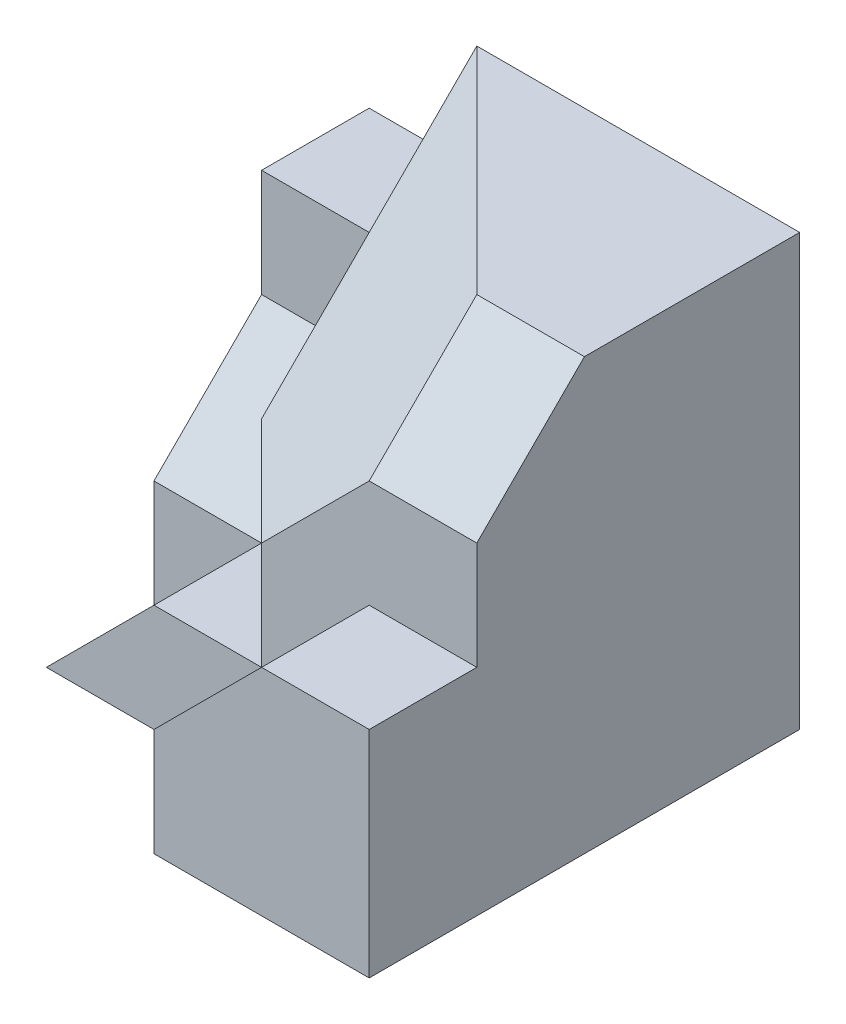
ISO-10303-21;
HEADER;
FILE_DESCRIPTION(('STEP AP214'),'2;1');
FILE_NAME('part.step','',(''),(''),'','','');
FILE_SCHEMA(('AUTOMOTIVE_DESIGN { 1 0 10303 214 1 1 1 1 }'));
ENDSEC;
DATA;
#1=APPLICATION_CONTEXT('core data for automotive mechanical design processes');
#2=APPLICATION_PROTOCOL_DEFINITION('international standard','automotive_design',2000,#1);
#3=PRODUCT_CONTEXT('',#1,'mechanical');
#4=PRODUCT('Part','Part','',(#3));
#5=PRODUCT_RELATED_PRODUCT_CATEGORY('part','',(#4));
#6=PRODUCT_DEFINITION_FORMATION('','',#4);
#7=PRODUCT_DEFINITION_CONTEXT('part definition',#1,'design');
#8=PRODUCT_DEFINITION('design','',#6,#7);
#9=PRODUCT_DEFINITION_SHAPE('','',#8);
#10=(LENGTH_UNIT() NAMED_UNIT(*) SI_UNIT(.MILLI.,.METRE.));
#11=(NAMED_UNIT(*) PLANE_ANGLE_UNIT() SI_UNIT($,.RADIAN.));
#12=(NAMED_UNIT(*) SI_UNIT($,.STERADIAN.) SOLID_ANGLE_UNIT());
#13=UNCERTAINTY_MEASURE_WITH_UNIT(LENGTH_MEASURE(1.E-05),#10,'distance_accuracy_value','');
#14=(GEOMETRIC_REPRESENTATION_CONTEXT(3) GLOBAL_UNCERTAINTY_ASSIGNED_CONTEXT((#13)) GLOBAL_UNIT_ASSIGNED_CONTEXT((#10,
#11,#12)) REPRESENTATION_CONTEXT('',''));
#15=CARTESIAN_POINT('',(0.,0.,0.));
#16=DIRECTION('',(0.,0.,1.));
#17=DIRECTION('',(1.,0.,0.));
#18=AXIS2_PLACEMENT_3D('',#15,#16,#17);
#19=CARTESIAN_POINT('',(-15.,-12.,10.));
#20=DIRECTION('',(0.707106781186548,0.,-0.707106781186548));
#21=DIRECTION('',(-0.707106781186548,0.,-0.707106781186548));
#22=AXIS2_PLACEMENT_3D('',#19,#20,#21);
#23=PLANE('',#22);
#24=DIRECTION('',(0.707106781186548,0.,0.707106781186548));
#25=VECTOR('',#24,1.);
#26=CARTESIAN_POINT('',(-15.,5.,10.));
#27=LINE('',#26,#25);
#28=CARTESIAN_POINT('',(-15.,5.,10.));
#29=VERTEX_POINT('',#28);
#30=CARTESIAN_POINT('',(-10.,5.,15.));
#31=VERTEX_POINT('',#30);
#32=EDGE_CURVE('E198',#29,#31,#27,.T.);
#33=ORIENTED_EDGE('',*,*,#32,.T.);
#34=DIRECTION('',(0.,1.,0.));
#35=VECTOR('',#34,1.);
#36=CARTESIAN_POINT('',(-10.,-12.,15.));
#37=LINE('',#36,#35);
#38=CARTESIAN_POINT('',(-10.,10.,15.));
#39=VERTEX_POINT('',#38);
#40=EDGE_CURVE('E236',#31,#39,#37,.T.);
#41=ORIENTED_EDGE('',*,*,#40,.T.);
#42=DIRECTION('',(-0.707106781186548,0.,-0.707106781186548));
#43=VECTOR('',#42,1.);
#44=CARTESIAN_POINT('',(-10.,10.,15.));
#45=LINE('',#44,#43);
#46=CARTESIAN_POINT('',(-15.,10.,10.));
#47=VERTEX_POINT('',#46);
#48=EDGE_CURVE('E244',#39,#47,#45,.T.);
#49=ORIENTED_EDGE('',*,*,#48,.T.);
#50=DIRECTION('',(0.,1.,0.));
#51=VECTOR('',#50,1.);
#52=CARTESIAN_POINT('',(-15.,-12.,10.));
#53=LINE('',#52,#51);
#54=EDGE_CURVE('E248',#29,#47,#53,.T.);
#55=ORIENTED_EDGE('',*,*,#54,.F.);
#56=EDGE_LOOP('',(#33,#41,#49,#55));
#57=FACE_BOUND('',#56,.T.);
#58=ADVANCED_FACE('F34',(#57),#23,.F.);
#59=CARTESIAN_POINT('',(-15.,20.,15.));
#60=DIRECTION('',(-1.,0.,0.));
#61=DIRECTION('',(0.,0.,1.));
#62=AXIS2_PLACEMENT_3D('',#59,#60,#61);
#63=PLANE('',#62);
#64=DIRECTION('',(0.,0.,-1.));
#65=VECTOR('',#64,1.);
#66=CARTESIAN_POINT('',(-15.,15.,0.));
#67=LINE('',#66,#65);
#68=CARTESIAN_POINT('',(-15.,15.,5.));
#69=VERTEX_POINT('',#68);
#70=CARTESIAN_POINT('',(-15.,15.,0.));
#71=VERTEX_POINT('',#70);
#72=EDGE_CURVE('E54',#69,#71,#67,.T.);
#73=ORIENTED_EDGE('',*,*,#72,.F.);
#74=DIRECTION('',(0.,0.707106781186548,-0.707106781186547));
#75=VECTOR('',#74,1.);
#76=CARTESIAN_POINT('',(-15.,10.,10.));
#77=LINE('',#76,#75);
#78=CARTESIAN_POINT('',(-15.,20.,0.));
#79=VERTEX_POINT('',#78);
#80=EDGE_CURVE('E255',#69,#79,#77,.T.);
#81=ORIENTED_EDGE('',*,*,#80,.T.);
#82=DIRECTION('',(0.,-1.,0.));
#83=VECTOR('',#82,1.);
#84=CARTESIAN_POINT('',(-15.,20.,0.));
#85=LINE('',#84,#83);
#86=EDGE_CURVE('E51',#79,#71,#85,.T.);
#87=ORIENTED_EDGE('',*,*,#86,.T.);
#88=EDGE_LOOP('',(#73,#81,#87));
#89=FACE_BOUND('',#88,.T.);
#90=ADVANCED_FACE('F295',(#89),#63,.T.);
#91=CARTESIAN_POINT('',(0.,20.,15.));
#92=DIRECTION('',(0.,0.,-1.));
#93=DIRECTION('',(-1.,0.,0.));
#94=AXIS2_PLACEMENT_3D('',#91,#92,#93);
#95=PLANE('',#94);
#96=DIRECTION('',(-0.707106781186548,-0.707106781186547,0.));
#97=VECTOR('',#96,1.);
#98=CARTESIAN_POINT('',(-10.,5.,15.));
#99=LINE('',#98,#97);
#100=CARTESIAN_POINT('',(-5.,10.,15.));
#101=VERTEX_POINT('',#100);
#102=EDGE_CURVE('E151',#101,#31,#99,.T.);
#103=ORIENTED_EDGE('',*,*,#102,.F.);
#104=DIRECTION('',(-1.,0.,0.));
#105=VECTOR('',#104,1.);
#106=CARTESIAN_POINT('',(-5.,10.,15.));
#107=LINE('',#106,#105);
#108=CARTESIAN_POINT('',(0.,10.,15.));
#109=VERTEX_POINT('',#108);
#110=EDGE_CURVE('E358',#109,#101,#107,.T.);
#111=ORIENTED_EDGE('',*,*,#110,.F.);
#112=DIRECTION('',(0.,-1.,0.));
#113=VECTOR('',#112,1.);
#114=CARTESIAN_POINT('',(0.,20.,15.));
#115=LINE('',#114,#113);
#116=CARTESIAN_POINT('',(0.,15.0000000000001,15.));
#117=VERTEX_POINT('',#116);
#118=EDGE_CURVE('E43',#117,#109,#115,.T.);
#119=ORIENTED_EDGE('',*,*,#118,.F.);
#120=DIRECTION('',(-1.,0.,0.));
#121=VECTOR('',#120,1.);
#122=CARTESIAN_POINT('',(25.,15.0000000000001,15.));
#123=LINE('',#122,#121);
#124=CARTESIAN_POINT('',(-4.99999999999999,15.0000000000001,15.));
#125=VERTEX_POINT('',#124);
#126=EDGE_CURVE('E402',#117,#125,#123,.T.);
#127=ORIENTED_EDGE('',*,*,#126,.T.);
#128=DIRECTION('',(-0.707106781186539,-0.707106781186556,0.));
#129=VECTOR('',#128,1.);
#130=CARTESIAN_POINT('',(-4.99999999999999,15.0000000000001,15.));
#131=LINE('',#130,#129);
#132=EDGE_CURVE('E247',#125,#39,#131,.T.);
#133=ORIENTED_EDGE('',*,*,#132,.T.);
#134=ORIENTED_EDGE('',*,*,#40,.F.);
#135=EDGE_LOOP('',(#103,#111,#119,#127,#133,#134));
#136=FACE_BOUND('',#135,.T.);
#137=ADVANCED_FACE('F36',(#136),#95,.F.);
#138=CARTESIAN_POINT('',(0.,20.,0.));
#139=DIRECTION('',(-1.,0.,0.));
#140=DIRECTION('',(0.,0.,1.));
#141=AXIS2_PLACEMENT_3D('',#138,#139,#140);
#142=PLANE('',#141);
#143=DIRECTION('',(0.,0.,-1.));
#144=VECTOR('',#143,1.);
#145=CARTESIAN_POINT('',(0.,20.,0.));
#146=LINE('',#145,#144);
#147=CARTESIAN_POINT('',(0.,20.,10.));
#148=VERTEX_POINT('',#147);
#149=CARTESIAN_POINT('',(0.,20.,0.));
#150=VERTEX_POINT('',#149);
#151=EDGE_CURVE('E334',#148,#150,#146,.T.);
#152=ORIENTED_EDGE('',*,*,#151,.F.);
#153=DIRECTION('',(0.,-0.707106781186539,0.707106781186556));
#154=VECTOR('',#153,1.);
#155=CARTESIAN_POINT('',(0.,25.,4.99999999999988));
#156=LINE('',#155,#154);
#157=EDGE_CURVE('E336',#148,#117,#156,.T.);
#158=ORIENTED_EDGE('',*,*,#157,.T.);
#159=ORIENTED_EDGE('',*,*,#118,.T.);
#160=DIRECTION('',(0.,0.,-1.));
#161=VECTOR('',#160,1.);
#162=CARTESIAN_POINT('',(0.,10.,20.));
#163=LINE('',#162,#161);
#164=CARTESIAN_POINT('',(0.,10.,20.));
#165=VERTEX_POINT('',#164);
#166=EDGE_CURVE('E233',#165,#109,#163,.T.);
#167=ORIENTED_EDGE('',*,*,#166,.F.);
#168=DIRECTION('',(0.,1.,0.));
#169=VECTOR('',#168,1.);
#170=CARTESIAN_POINT('',(0.,10.,20.));
#171=LINE('',#170,#169);
#172=CARTESIAN_POINT('',(0.,0.,20.));
#173=VERTEX_POINT('',#172);
#174=EDGE_CURVE('E372',#173,#165,#171,.T.);
#175=ORIENTED_EDGE('',*,*,#174,.F.);
#176=DIRECTION('',(0.,0.,-1.));
#177=VECTOR('',#176,1.);
#178=CARTESIAN_POINT('',(0.,0.,0.));
#179=LINE('',#178,#177);
#180=CARTESIAN_POINT('',(0.,0.,0.));
#181=VERTEX_POINT('',#180);
#182=EDGE_CURVE('E344',#173,#181,#179,.T.);
#183=ORIENTED_EDGE('',*,*,#182,.T.);
#184=DIRECTION('',(0.,-1.,0.));
#185=VECTOR('',#184,1.);
#186=CARTESIAN_POINT('',(0.,20.,0.));
#187=LINE('',#186,#185);
#188=EDGE_CURVE('E339',#150,#181,#187,.T.);
#189=ORIENTED_EDGE('',*,*,#188,.F.);
#190=EDGE_LOOP('',(#152,#158,#159,#167,#175,#183,#189));
#191=FACE_BOUND('',#190,.T.);
#192=ADVANCED_FACE('F302',(#191),#142,.F.);
#193=CARTESIAN_POINT('',(-15.,20.,0.));
#194=DIRECTION('',(0.,0.,1.));
#195=DIRECTION('',(1.,0.,0.));
#196=AXIS2_PLACEMENT_3D('',#193,#194,#195);
#197=PLANE('',#196);
#198=DIRECTION('',(-1.,0.,0.));
#199=VECTOR('',#198,1.);
#200=CARTESIAN_POINT('',(-15.,0.,0.));
#201=LINE('',#200,#199);
#202=CARTESIAN_POINT('',(-20.,0.,0.));
#203=VERTEX_POINT('',#202);
#204=EDGE_CURVE('E341',#181,#203,#201,.T.);
#205=ORIENTED_EDGE('',*,*,#204,.T.);
#206=DIRECTION('',(0.,-1.,0.));
#207=VECTOR('',#206,1.);
#208=CARTESIAN_POINT('',(-20.,0.,0.));
#209=LINE('',#208,#207);
#210=CARTESIAN_POINT('',(-20.,15.,0.));
#211=VERTEX_POINT('',#210);
#212=EDGE_CURVE('E175',#211,#203,#209,.T.);
#213=ORIENTED_EDGE('',*,*,#212,.F.);
#214=DIRECTION('',(1.,0.,0.));
#215=VECTOR('',#214,1.);
#216=CARTESIAN_POINT('',(-20.,15.,0.));
#217=LINE('',#216,#215);
#218=EDGE_CURVE('E177',#211,#71,#217,.T.);
#219=ORIENTED_EDGE('',*,*,#218,.T.);
#220=ORIENTED_EDGE('',*,*,#86,.F.);
#221=DIRECTION('',(-1.,0.,0.));
#222=VECTOR('',#221,1.);
#223=CARTESIAN_POINT('',(-15.,20.,0.));
#224=LINE('',#223,#222);
#225=EDGE_CURVE('E340',#150,#79,#224,.T.);
#226=ORIENTED_EDGE('',*,*,#225,.F.);
#227=ORIENTED_EDGE('',*,*,#188,.T.);
#228=EDGE_LOOP('',(#205,#213,#219,#220,#226,#227));
#229=FACE_BOUND('',#228,.T.);
#230=ADVANCED_FACE('F275',(#229),#197,.F.);
#231=CARTESIAN_POINT('',(0.,20.,0.));
#232=DIRECTION('',(0.,-1.,0.));
#233=DIRECTION('',(0.,0.,-1.));
#234=AXIS2_PLACEMENT_3D('',#231,#232,#233);
#235=PLANE('',#234);
#236=ORIENTED_EDGE('',*,*,#225,.T.);
#237=DIRECTION('',(0.707106781186548,0.,0.707106781186547));
#238=VECTOR('',#237,1.);
#239=CARTESIAN_POINT('',(-15.,20.,0.));
#240=LINE('',#239,#238);
#241=CARTESIAN_POINT('',(-4.99999999999999,20.,10.));
#242=VERTEX_POINT('',#241);
#243=EDGE_CURVE('E258',#79,#242,#240,.T.);
#244=ORIENTED_EDGE('',*,*,#243,.T.);
#245=DIRECTION('',(1.,0.,0.));
#246=VECTOR('',#245,1.);
#247=CARTESIAN_POINT('',(0.,20.,10.));
#248=LINE('',#247,#246);
#249=EDGE_CURVE('E12',#242,#148,#248,.T.);
#250=ORIENTED_EDGE('',*,*,#249,.T.);
#251=ORIENTED_EDGE('',*,*,#151,.T.);
#252=EDGE_LOOP('',(#236,#244,#250,#251));
#253=FACE_BOUND('',#252,.T.);
#254=ADVANCED_FACE('F319',(#253),#235,.F.);
#255=CARTESIAN_POINT('',(0.,0.,0.));
#256=DIRECTION('',(0.,-1.,0.));
#257=DIRECTION('',(0.,0.,-1.));
#258=AXIS2_PLACEMENT_3D('',#255,#256,#257);
#259=PLANE('',#258);
#260=DIRECTION('',(0.,0.,-1.));
#261=VECTOR('',#260,1.);
#262=CARTESIAN_POINT('',(-10.,0.,20.));
#263=LINE('',#262,#261);
#264=CARTESIAN_POINT('',(-10.,0.,20.));
#265=VERTEX_POINT('',#264);
#266=CARTESIAN_POINT('',(-10.,0.,15.));
#267=VERTEX_POINT('',#266);
#268=EDGE_CURVE('E228',#265,#267,#263,.T.);
#269=ORIENTED_EDGE('',*,*,#268,.T.);
#270=DIRECTION('',(-1.,0.,0.));
#271=VECTOR('',#270,1.);
#272=CARTESIAN_POINT('',(-10.,0.,15.));
#273=LINE('',#272,#271);
#274=CARTESIAN_POINT('',(-20.,0.,15.));
#275=VERTEX_POINT('',#274);
#276=EDGE_CURVE('E203',#267,#275,#273,.T.);
#277=ORIENTED_EDGE('',*,*,#276,.T.);
#278=DIRECTION('',(0.,0.,1.));
#279=VECTOR('',#278,1.);
#280=CARTESIAN_POINT('',(-20.,0.,10.));
#281=LINE('',#280,#279);
#282=CARTESIAN_POINT('',(-20.,0.,10.));
#283=VERTEX_POINT('',#282);
#284=EDGE_CURVE('E210',#283,#275,#281,.T.);
#285=ORIENTED_EDGE('',*,*,#284,.F.);
#286=DIRECTION('',(0.,0.,1.));
#287=VECTOR('',#286,1.);
#288=CARTESIAN_POINT('',(-20.,0.,10.));
#289=LINE('',#288,#287);
#290=EDGE_CURVE('E161',#203,#283,#289,.T.);
#291=ORIENTED_EDGE('',*,*,#290,.F.);
#292=ORIENTED_EDGE('',*,*,#204,.F.);
#293=ORIENTED_EDGE('',*,*,#182,.F.);
#294=DIRECTION('',(1.,0.,0.));
#295=VECTOR('',#294,1.);
#296=CARTESIAN_POINT('',(0.,0.,20.));
#297=LINE('',#296,#295);
#298=EDGE_CURVE('E230',#265,#173,#297,.T.);
#299=ORIENTED_EDGE('',*,*,#298,.F.);
#300=EDGE_LOOP('',(#269,#277,#285,#291,#292,#293,#299));
#301=FACE_BOUND('',#300,.T.);
#302=ADVANCED_FACE('F225',(#301),#259,.T.);
#303=CARTESIAN_POINT('',(25.,20.,10.));
#304=DIRECTION('',(0.,-0.707106781186556,-0.707106781186539));
#305=DIRECTION('',(0.,0.707106781186539,-0.707106781186556));
#306=AXIS2_PLACEMENT_3D('',#303,#304,#305);
#307=PLANE('',#306);
#308=ORIENTED_EDGE('',*,*,#249,.F.);
#309=DIRECTION('',(0.,-0.707106781186539,0.707106781186556));
#310=VECTOR('',#309,1.);
#311=CARTESIAN_POINT('',(-4.99999999999999,20.,10.));
#312=LINE('',#311,#310);
#313=EDGE_CURVE('E254',#242,#125,#312,.T.);
#314=ORIENTED_EDGE('',*,*,#313,.T.);
#315=ORIENTED_EDGE('',*,*,#126,.F.);
#316=ORIENTED_EDGE('',*,*,#157,.F.);
#317=EDGE_LOOP('',(#308,#314,#315,#316));
#318=FACE_BOUND('',#317,.T.);
#319=ADVANCED_FACE('F309',(#318),#307,.F.);
#320=DIRECTION('',(0.,1.,0.));
#321=VECTOR('',#320,1.);
#322=CARTESIAN_POINT('',(-15.,15.,5.));
#323=LINE('',#322,#321);
#324=CARTESIAN_POINT('',(-15.,10.,5.));
#325=VERTEX_POINT('',#324);
#326=EDGE_CURVE('E183',#325,#69,#323,.T.);
#327=ORIENTED_EDGE('',*,*,#326,.F.);
#328=DIRECTION('',(0.,0.707106781186548,-0.707106781186547));
#329=VECTOR('',#328,1.);
#330=CARTESIAN_POINT('',(-15.,10.,5.));
#331=LINE('',#330,#329);
#332=EDGE_CURVE('E187',#29,#325,#331,.T.);
#333=ORIENTED_EDGE('',*,*,#332,.F.);
#334=ORIENTED_EDGE('',*,*,#54,.T.);
#335=EDGE_CURVE('E251',#47,#69,#77,.T.);
#336=ORIENTED_EDGE('',*,*,#335,.T.);
#337=EDGE_LOOP('',(#327,#333,#334,#336));
#338=FACE_BOUND('',#337,.T.);
#339=ADVANCED_FACE('F285',(#338),#63,.T.);
#340=CARTESIAN_POINT('',(-11.6666666666667,11.6666666666667,11.6666666666666));
#341=DIRECTION('',(0.577350269189628,-0.577350269189626,-0.577350269189624));
#342=DIRECTION('',(0.707106781186546,0.707106781186549,0.));
#343=AXIS2_PLACEMENT_3D('',#340,#341,#342);
#344=PLANE('',#343);
#345=ORIENTED_EDGE('',*,*,#48,.F.);
#346=ORIENTED_EDGE('',*,*,#132,.F.);
#347=ORIENTED_EDGE('',*,*,#313,.F.);
#348=ORIENTED_EDGE('',*,*,#243,.F.);
#349=ORIENTED_EDGE('',*,*,#80,.F.);
#350=ORIENTED_EDGE('',*,*,#335,.F.);
#351=EDGE_LOOP('',(#345,#346,#347,#348,#349,#350));
#352=FACE_BOUND('',#351,.T.);
#353=ADVANCED_FACE('F290',(#352),#344,.F.);
#354=CARTESIAN_POINT('',(-10.,5.,20.));
#355=DIRECTION('',(0.707106781186547,-0.707106781186548,0.));
#356=DIRECTION('',(0.707106781186548,0.707106781186547,0.));
#357=AXIS2_PLACEMENT_3D('',#354,#355,#356);
#358=PLANE('',#357);
#359=ORIENTED_EDGE('',*,*,#102,.T.);
#360=DIRECTION('',(0.,0.,-1.));
#361=VECTOR('',#360,1.);
#362=CARTESIAN_POINT('',(-10.,5.,20.));
#363=LINE('',#362,#361);
#364=CARTESIAN_POINT('',(-10.,5.,20.));
#365=VERTEX_POINT('',#364);
#366=EDGE_CURVE('E232',#365,#31,#363,.T.);
#367=ORIENTED_EDGE('',*,*,#366,.F.);
#368=DIRECTION('',(-0.707106781186548,-0.707106781186547,0.));
#369=VECTOR('',#368,1.);
#370=CARTESIAN_POINT('',(-10.,5.,20.));
#371=LINE('',#370,#369);
#372=CARTESIAN_POINT('',(-5.,10.,20.));
#373=VERTEX_POINT('',#372);
#374=EDGE_CURVE('E361',#373,#365,#371,.T.);
#375=ORIENTED_EDGE('',*,*,#374,.F.);
#376=DIRECTION('',(0.,0.,-1.));
#377=VECTOR('',#376,1.);
#378=CARTESIAN_POINT('',(-5.,10.,20.));
#379=LINE('',#378,#377);
#380=EDGE_CURVE('E239',#373,#101,#379,.T.);
#381=ORIENTED_EDGE('',*,*,#380,.T.);
#382=EDGE_LOOP('',(#359,#367,#375,#381));
#383=FACE_BOUND('',#382,.T.);
#384=ADVANCED_FACE('F314',(#383),#358,.F.);
#385=CARTESIAN_POINT('',(-10.,0.,20.));
#386=DIRECTION('',(1.,0.,0.));
#387=DIRECTION('',(0.,0.,-1.));
#388=AXIS2_PLACEMENT_3D('',#385,#386,#387);
#389=PLANE('',#388);
#390=EDGE_CURVE('E387',#267,#31,#37,.T.);
#391=ORIENTED_EDGE('',*,*,#390,.F.);
#392=ORIENTED_EDGE('',*,*,#268,.F.);
#393=DIRECTION('',(0.,-1.,0.));
#394=VECTOR('',#393,1.);
#395=CARTESIAN_POINT('',(-10.,0.,20.));
#396=LINE('',#395,#394);
#397=EDGE_CURVE('E375',#365,#265,#396,.T.);
#398=ORIENTED_EDGE('',*,*,#397,.F.);
#399=ORIENTED_EDGE('',*,*,#366,.T.);
#400=EDGE_LOOP('',(#391,#392,#398,#399));
#401=FACE_BOUND('',#400,.T.);
#402=ADVANCED_FACE('F386',(#401),#389,.F.);
#403=CARTESIAN_POINT('',(-5.,10.,20.));
#404=DIRECTION('',(0.,-1.,0.));
#405=DIRECTION('',(0.,0.,-1.));
#406=AXIS2_PLACEMENT_3D('',#403,#404,#405);
#407=PLANE('',#406);
#408=ORIENTED_EDGE('',*,*,#110,.T.);
#409=ORIENTED_EDGE('',*,*,#380,.F.);
#410=DIRECTION('',(-1.,0.,0.));
#411=VECTOR('',#410,1.);
#412=CARTESIAN_POINT('',(-5.,10.,20.));
#413=LINE('',#412,#411);
#414=EDGE_CURVE('E370',#165,#373,#413,.T.);
#415=ORIENTED_EDGE('',*,*,#414,.F.);
#416=ORIENTED_EDGE('',*,*,#166,.T.);
#417=EDGE_LOOP('',(#408,#409,#415,#416));
#418=FACE_BOUND('',#417,.T.);
#419=ADVANCED_FACE('F431',(#418),#407,.F.);
#420=CARTESIAN_POINT('',(0.,0.,20.));
#421=DIRECTION('',(0.,0.,-1.));
#422=DIRECTION('',(-1.,0.,0.));
#423=AXIS2_PLACEMENT_3D('',#420,#421,#422);
#424=PLANE('',#423);
#425=ORIENTED_EDGE('',*,*,#374,.T.);
#426=ORIENTED_EDGE('',*,*,#397,.T.);
#427=ORIENTED_EDGE('',*,*,#298,.T.);
#428=ORIENTED_EDGE('',*,*,#174,.T.);
#429=ORIENTED_EDGE('',*,*,#414,.T.);
#430=EDGE_LOOP('',(#425,#426,#427,#428,#429));
#431=FACE_BOUND('',#430,.T.);
#432=ADVANCED_FACE('F381',(#431),#424,.F.);
#433=CARTESIAN_POINT('',(-20.,10.,5.));
#434=DIRECTION('',(0.,-0.707106781186547,-0.707106781186548));
#435=DIRECTION('',(0.,0.707106781186548,-0.707106781186547));
#436=AXIS2_PLACEMENT_3D('',#433,#434,#435);
#437=PLANE('',#436);
#438=ORIENTED_EDGE('',*,*,#332,.T.);
#439=DIRECTION('',(1.,0.,0.));
#440=VECTOR('',#439,1.);
#441=CARTESIAN_POINT('',(-20.,10.,5.));
#442=LINE('',#441,#440);
#443=CARTESIAN_POINT('',(-20.,10.,5.));
#444=VERTEX_POINT('',#443);
#445=EDGE_CURVE('E152',#444,#325,#442,.T.);
#446=ORIENTED_EDGE('',*,*,#445,.F.);
#447=DIRECTION('',(0.,0.707106781186548,-0.707106781186547));
#448=VECTOR('',#447,1.);
#449=CARTESIAN_POINT('',(-20.,10.,5.));
#450=LINE('',#449,#448);
#451=CARTESIAN_POINT('',(-20.,5.,10.));
#452=VERTEX_POINT('',#451);
#453=EDGE_CURVE('E157',#452,#444,#450,.T.);
#454=ORIENTED_EDGE('',*,*,#453,.F.);
#455=DIRECTION('',(1.,0.,0.));
#456=VECTOR('',#455,1.);
#457=CARTESIAN_POINT('',(-20.,5.,10.));
#458=LINE('',#457,#456);
#459=EDGE_CURVE('E141',#452,#29,#458,.T.);
#460=ORIENTED_EDGE('',*,*,#459,.T.);
#461=EDGE_LOOP('',(#438,#446,#454,#460));
#462=FACE_BOUND('',#461,.T.);
#463=ADVANCED_FACE('F164',(#462),#437,.F.);
#464=CARTESIAN_POINT('',(-20.,15.,5.));
#465=DIRECTION('',(0.,0.,-1.));
#466=DIRECTION('',(0.,1.,0.));
#467=AXIS2_PLACEMENT_3D('',#464,#465,#466);
#468=PLANE('',#467);
#469=ORIENTED_EDGE('',*,*,#326,.T.);
#470=DIRECTION('',(1.,0.,0.));
#471=VECTOR('',#470,1.);
#472=CARTESIAN_POINT('',(-20.,15.,5.));
#473=LINE('',#472,#471);
#474=CARTESIAN_POINT('',(-20.,15.,5.));
#475=VERTEX_POINT('',#474);
#476=EDGE_CURVE('E190',#475,#69,#473,.T.);
#477=ORIENTED_EDGE('',*,*,#476,.F.);
#478=DIRECTION('',(0.,1.,0.));
#479=VECTOR('',#478,1.);
#480=CARTESIAN_POINT('',(-20.,15.,5.));
#481=LINE('',#480,#479);
#482=EDGE_CURVE('E167',#444,#475,#481,.T.);
#483=ORIENTED_EDGE('',*,*,#482,.F.);
#484=ORIENTED_EDGE('',*,*,#445,.T.);
#485=EDGE_LOOP('',(#469,#477,#483,#484));
#486=FACE_BOUND('',#485,.T.);
#487=ADVANCED_FACE('F282',(#486),#468,.F.);
#488=CARTESIAN_POINT('',(-20.,15.,0.));
#489=DIRECTION('',(0.,-1.,0.));
#490=DIRECTION('',(0.,0.,-1.));
#491=AXIS2_PLACEMENT_3D('',#488,#489,#490);
#492=PLANE('',#491);
#493=ORIENTED_EDGE('',*,*,#72,.T.);
#494=ORIENTED_EDGE('',*,*,#218,.F.);
#495=DIRECTION('',(0.,0.,-1.));
#496=VECTOR('',#495,1.);
#497=CARTESIAN_POINT('',(-20.,15.,0.));
#498=LINE('',#497,#496);
#499=EDGE_CURVE('E169',#475,#211,#498,.T.);
#500=ORIENTED_EDGE('',*,*,#499,.F.);
#501=ORIENTED_EDGE('',*,*,#476,.T.);
#502=EDGE_LOOP('',(#493,#494,#500,#501));
#503=FACE_BOUND('',#502,.T.);
#504=ADVANCED_FACE('F279',(#503),#492,.F.);
#505=CARTESIAN_POINT('',(-20.,0.,0.));
#506=DIRECTION('',(1.,0.,0.));
#507=DIRECTION('',(0.,0.,-1.));
#508=AXIS2_PLACEMENT_3D('',#505,#506,#507);
#509=PLANE('',#508);
#510=ORIENTED_EDGE('',*,*,#290,.T.);
#511=DIRECTION('',(0.,-1.,0.));
#512=VECTOR('',#511,1.);
#513=CARTESIAN_POINT('',(-20.,0.,10.));
#514=LINE('',#513,#512);
#515=EDGE_CURVE('E144',#452,#283,#514,.T.);
#516=ORIENTED_EDGE('',*,*,#515,.F.);
#517=ORIENTED_EDGE('',*,*,#453,.T.);
#518=ORIENTED_EDGE('',*,*,#482,.T.);
#519=ORIENTED_EDGE('',*,*,#499,.T.);
#520=ORIENTED_EDGE('',*,*,#212,.T.);
#521=EDGE_LOOP('',(#510,#516,#517,#518,#519,#520));
#522=FACE_BOUND('',#521,.T.);
#523=ADVANCED_FACE('F156',(#522),#509,.F.);
#524=CARTESIAN_POINT('',(-10.,5.,15.));
#525=DIRECTION('',(0.,0.,1.));
#526=DIRECTION('',(1.,0.,0.));
#527=AXIS2_PLACEMENT_3D('',#524,#525,#526);
#528=PLANE('',#527);
#529=DIRECTION('',(0.707106781186547,0.707106781186548,0.));
#530=VECTOR('',#529,1.);
#531=CARTESIAN_POINT('',(-15.,5.,15.));
#532=LINE('',#531,#530);
#533=CARTESIAN_POINT('',(-15.,5.,15.));
#534=VERTEX_POINT('',#533);
#535=EDGE_CURVE('E207',#275,#534,#532,.T.);
#536=ORIENTED_EDGE('',*,*,#535,.F.);
#537=ORIENTED_EDGE('',*,*,#276,.F.);
#538=ORIENTED_EDGE('',*,*,#390,.T.);
#539=DIRECTION('',(-1.,0.,0.));
#540=VECTOR('',#539,1.);
#541=CARTESIAN_POINT('',(-10.,5.,15.));
#542=LINE('',#541,#540);
#543=EDGE_CURVE('E195',#31,#534,#542,.T.);
#544=ORIENTED_EDGE('',*,*,#543,.T.);
#545=EDGE_LOOP('',(#536,#537,#538,#544));
#546=FACE_BOUND('',#545,.T.);
#547=ADVANCED_FACE('F221',(#546),#528,.T.);
#548=CARTESIAN_POINT('',(0.,5.,0.));
#549=DIRECTION('',(0.,-1.,0.));
#550=DIRECTION('',(0.,0.,-1.));
#551=AXIS2_PLACEMENT_3D('',#548,#549,#550);
#552=PLANE('',#551);
#553=ORIENTED_EDGE('',*,*,#32,.F.);
#554=DIRECTION('',(0.,0.,1.));
#555=VECTOR('',#554,1.);
#556=CARTESIAN_POINT('',(-15.,5.,10.));
#557=LINE('',#556,#555);
#558=EDGE_CURVE('E162',#29,#534,#557,.T.);
#559=ORIENTED_EDGE('',*,*,#558,.T.);
#560=ORIENTED_EDGE('',*,*,#543,.F.);
#561=EDGE_LOOP('',(#553,#559,#560));
#562=FACE_BOUND('',#561,.T.);
#563=ADVANCED_FACE('F410',(#562),#552,.F.);
#564=CARTESIAN_POINT('',(-15.,5.,10.));
#565=DIRECTION('',(0.707106781186548,-0.707106781186547,0.));
#566=DIRECTION('',(0.707106781186547,0.707106781186548,0.));
#567=AXIS2_PLACEMENT_3D('',#564,#565,#566);
#568=PLANE('',#567);
#569=ORIENTED_EDGE('',*,*,#535,.T.);
#570=ORIENTED_EDGE('',*,*,#558,.F.);
#571=DIRECTION('',(0.707106781186547,0.707106781186548,0.));
#572=VECTOR('',#571,1.);
#573=CARTESIAN_POINT('',(-15.,5.,10.));
#574=LINE('',#573,#572);
#575=EDGE_CURVE('E146',#283,#29,#574,.T.);
#576=ORIENTED_EDGE('',*,*,#575,.F.);
#577=ORIENTED_EDGE('',*,*,#284,.T.);
#578=EDGE_LOOP('',(#569,#570,#576,#577));
#579=FACE_BOUND('',#578,.T.);
#580=ADVANCED_FACE('F219',(#579),#568,.F.);
#581=CARTESIAN_POINT('',(0.,0.,10.));
#582=DIRECTION('',(0.,0.,-1.));
#583=DIRECTION('',(-1.,0.,0.));
#584=AXIS2_PLACEMENT_3D('',#581,#582,#583);
#585=PLANE('',#584);
#586=ORIENTED_EDGE('',*,*,#575,.T.);
#587=ORIENTED_EDGE('',*,*,#459,.F.);
#588=ORIENTED_EDGE('',*,*,#515,.T.);
#589=EDGE_LOOP('',(#586,#587,#588));
#590=FACE_BOUND('',#589,.T.);
#591=ADVANCED_FACE('F143',(#590),#585,.F.);
#592=CLOSED_SHELL('',(#58,#90,#137,#192,#230,#254,#302,#319,#339,#353,#384,#402,#419,#432,#463,
#487,#504,#523,#547,#563,#580,#591));
#593=MANIFOLD_SOLID_BREP('B2',#592);
#594=ADVANCED_BREP_SHAPE_REPRESENTATION('',(#18,#593),#14);
#595=SHAPE_DEFINITION_REPRESENTATION(#9,#594);
ENDSEC;
END-ISO-10303-21;
